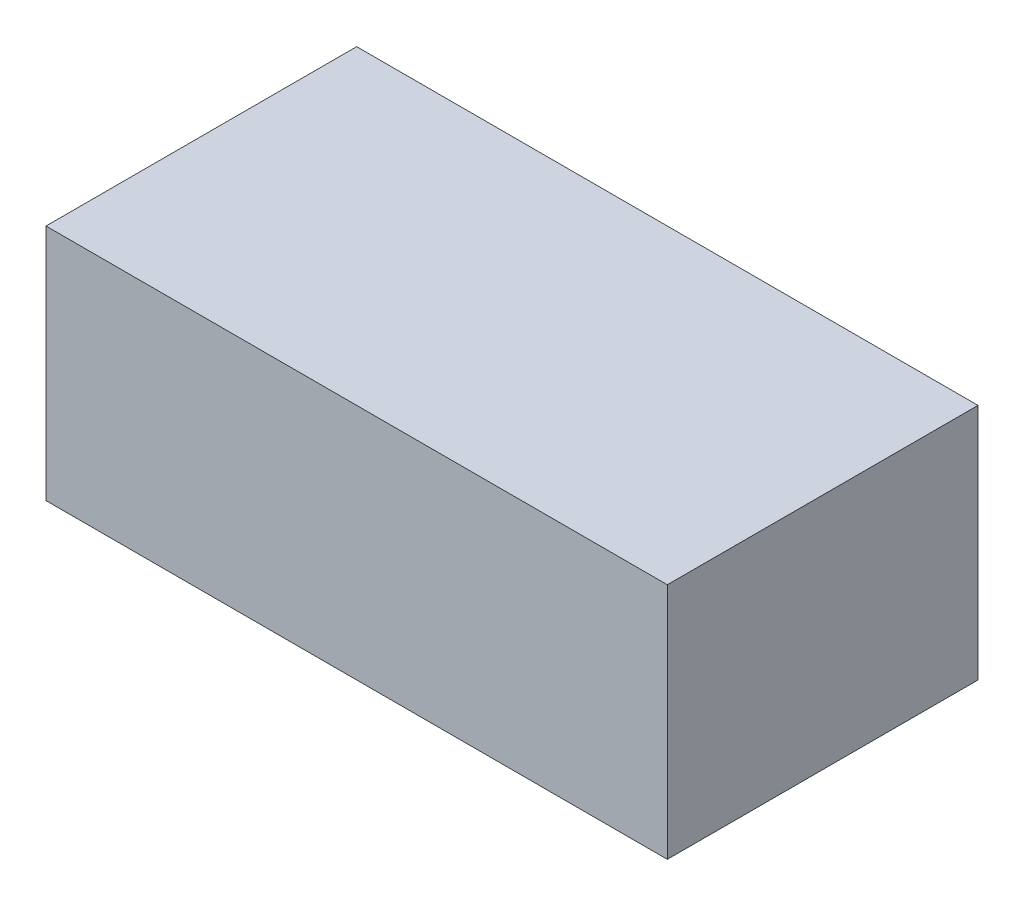
ISO-10303-21;
HEADER;
FILE_DESCRIPTION(('STEP AP214'),'2;1');
FILE_NAME('part.step','',(''),(''),'','','');
FILE_SCHEMA(('AUTOMOTIVE_DESIGN { 1 0 10303 214 1 1 1 1 }'));
ENDSEC;
DATA;
#1=APPLICATION_CONTEXT('core data for automotive mechanical design processes');
#2=APPLICATION_PROTOCOL_DEFINITION('international standard','automotive_design',2000,#1);
#3=PRODUCT_CONTEXT('',#1,'mechanical');
#4=PRODUCT('Part','Part','',(#3));
#5=PRODUCT_RELATED_PRODUCT_CATEGORY('part','',(#4));
#6=PRODUCT_DEFINITION_FORMATION('','',#4);
#7=PRODUCT_DEFINITION_CONTEXT('part definition',#1,'design');
#8=PRODUCT_DEFINITION('design','',#6,#7);
#9=PRODUCT_DEFINITION_SHAPE('','',#8);
#10=(LENGTH_UNIT() NAMED_UNIT(*) SI_UNIT(.MILLI.,.METRE.));
#11=(NAMED_UNIT(*) PLANE_ANGLE_UNIT() SI_UNIT($,.RADIAN.));
#12=(NAMED_UNIT(*) SI_UNIT($,.STERADIAN.) SOLID_ANGLE_UNIT());
#13=UNCERTAINTY_MEASURE_WITH_UNIT(LENGTH_MEASURE(1.E-05),#10,'distance_accuracy_value','');
#14=(GEOMETRIC_REPRESENTATION_CONTEXT(3) GLOBAL_UNCERTAINTY_ASSIGNED_CONTEXT((#13)) GLOBAL_UNIT_ASSIGNED_CONTEXT((#10,
#11,#12)) REPRESENTATION_CONTEXT('',''));
#15=CARTESIAN_POINT('',(0.,0.,0.));
#16=DIRECTION('',(0.,0.,1.));
#17=DIRECTION('',(1.,0.,0.));
#18=AXIS2_PLACEMENT_3D('',#15,#16,#17);
#19=CARTESIAN_POINT('',(0.,0.,0.));
#20=DIRECTION('',(0.,1.,0.));
#21=DIRECTION('',(0.,0.,1.));
#22=AXIS2_PLACEMENT_3D('',#19,#20,#21);
#23=PLANE('',#22);
#24=DIRECTION('',(0.,0.,-1.));
#25=VECTOR('',#24,1.);
#26=CARTESIAN_POINT('',(145.,0.,-72.5));
#27=LINE('',#26,#25);
#28=CARTESIAN_POINT('',(145.,0.,72.5));
#29=VERTEX_POINT('',#28);
#30=CARTESIAN_POINT('',(145.,0.,-72.5));
#31=VERTEX_POINT('',#30);
#32=EDGE_CURVE('E137',#29,#31,#27,.T.);
#33=ORIENTED_EDGE('',*,*,#32,.F.);
#34=DIRECTION('',(1.,0.,0.));
#35=VECTOR('',#34,1.);
#36=CARTESIAN_POINT('',(-145.,0.,72.5));
#37=LINE('',#36,#35);
#38=CARTESIAN_POINT('',(-145.,0.,72.5));
#39=VERTEX_POINT('',#38);
#40=EDGE_CURVE('E88',#39,#29,#37,.T.);
#41=ORIENTED_EDGE('',*,*,#40,.F.);
#42=DIRECTION('',(0.,0.,1.));
#43=VECTOR('',#42,1.);
#44=CARTESIAN_POINT('',(-145.,0.,-72.5));
#45=LINE('',#44,#43);
#46=CARTESIAN_POINT('',(-145.,0.,-72.5));
#47=VERTEX_POINT('',#46);
#48=EDGE_CURVE('E155',#47,#39,#45,.T.);
#49=ORIENTED_EDGE('',*,*,#48,.F.);
#50=DIRECTION('',(-1.,0.,0.));
#51=VECTOR('',#50,1.);
#52=CARTESIAN_POINT('',(-145.,0.,-72.5));
#53=LINE('',#52,#51);
#54=EDGE_CURVE('E141',#31,#47,#53,.T.);
#55=ORIENTED_EDGE('',*,*,#54,.F.);
#56=EDGE_LOOP('',(#33,#41,#49,#55));
#57=FACE_BOUND('',#56,.T.);
#58=DIRECTION('',(0.,0.,1.));
#59=VECTOR('',#58,1.);
#60=CARTESIAN_POINT('',(-143.,0.,-70.5));
#61=LINE('',#60,#59);
#62=CARTESIAN_POINT('',(-143.,0.,-70.5));
#63=VERTEX_POINT('',#62);
#64=CARTESIAN_POINT('',(-143.,0.,70.5));
#65=VERTEX_POINT('',#64);
#66=EDGE_CURVE('E58',#63,#65,#61,.T.);
#67=ORIENTED_EDGE('',*,*,#66,.T.);
#68=DIRECTION('',(1.,0.,0.));
#69=VECTOR('',#68,1.);
#70=CARTESIAN_POINT('',(-143.,0.,70.5));
#71=LINE('',#70,#69);
#72=CARTESIAN_POINT('',(143.,0.,70.5));
#73=VERTEX_POINT('',#72);
#74=EDGE_CURVE('E136',#65,#73,#71,.T.);
#75=ORIENTED_EDGE('',*,*,#74,.T.);
#76=DIRECTION('',(0.,0.,-1.));
#77=VECTOR('',#76,1.);
#78=CARTESIAN_POINT('',(143.,0.,-70.5));
#79=LINE('',#78,#77);
#80=CARTESIAN_POINT('',(143.,0.,-70.5));
#81=VERTEX_POINT('',#80);
#82=EDGE_CURVE('E269',#73,#81,#79,.T.);
#83=ORIENTED_EDGE('',*,*,#82,.T.);
#84=DIRECTION('',(-1.,0.,0.));
#85=VECTOR('',#84,1.);
#86=CARTESIAN_POINT('',(-143.,0.,-70.5));
#87=LINE('',#86,#85);
#88=EDGE_CURVE('E132',#81,#63,#87,.T.);
#89=ORIENTED_EDGE('',*,*,#88,.T.);
#90=EDGE_LOOP('',(#67,#75,#83,#89));
#91=FACE_BOUND('',#90,.T.);
#92=ADVANCED_FACE('F43',(#57,#91),#23,.F.);
#93=CARTESIAN_POINT('',(145.,111.,-72.5));
#94=DIRECTION('',(-1.,0.,0.));
#95=DIRECTION('',(0.,0.,1.));
#96=AXIS2_PLACEMENT_3D('',#93,#94,#95);
#97=PLANE('',#96);
#98=ORIENTED_EDGE('',*,*,#32,.T.);
#99=DIRECTION('',(0.,-1.,0.));
#100=VECTOR('',#99,1.);
#101=CARTESIAN_POINT('',(145.,111.,-72.5));
#102=LINE('',#101,#100);
#103=CARTESIAN_POINT('',(145.,111.,-72.5));
#104=VERTEX_POINT('',#103);
#105=EDGE_CURVE('E11',#104,#31,#102,.T.);
#106=ORIENTED_EDGE('',*,*,#105,.F.);
#107=DIRECTION('',(0.,0.,-1.));
#108=VECTOR('',#107,1.);
#109=CARTESIAN_POINT('',(145.,111.,-72.5));
#110=LINE('',#109,#108);
#111=CARTESIAN_POINT('',(145.,111.,72.5));
#112=VERTEX_POINT('',#111);
#113=EDGE_CURVE('E147',#112,#104,#110,.T.);
#114=ORIENTED_EDGE('',*,*,#113,.F.);
#115=DIRECTION('',(0.,-1.,0.));
#116=VECTOR('',#115,1.);
#117=CARTESIAN_POINT('',(145.,111.,72.5));
#118=LINE('',#117,#116);
#119=EDGE_CURVE('E152',#112,#29,#118,.T.);
#120=ORIENTED_EDGE('',*,*,#119,.T.);
#121=EDGE_LOOP('',(#98,#106,#114,#120));
#122=FACE_BOUND('',#121,.T.);
#123=ADVANCED_FACE('F45',(#122),#97,.F.);
#124=CARTESIAN_POINT('',(-145.,111.,-72.5));
#125=DIRECTION('',(0.,0.,1.));
#126=DIRECTION('',(1.,0.,0.));
#127=AXIS2_PLACEMENT_3D('',#124,#125,#126);
#128=PLANE('',#127);
#129=ORIENTED_EDGE('',*,*,#54,.T.);
#130=DIRECTION('',(0.,-1.,0.));
#131=VECTOR('',#130,1.);
#132=CARTESIAN_POINT('',(-145.,111.,-72.5));
#133=LINE('',#132,#131);
#134=CARTESIAN_POINT('',(-145.,111.,-72.5));
#135=VERTEX_POINT('',#134);
#136=EDGE_CURVE('E51',#135,#47,#133,.T.);
#137=ORIENTED_EDGE('',*,*,#136,.F.);
#138=DIRECTION('',(-1.,0.,0.));
#139=VECTOR('',#138,1.);
#140=CARTESIAN_POINT('',(-145.,111.,-72.5));
#141=LINE('',#140,#139);
#142=EDGE_CURVE('E95',#104,#135,#141,.T.);
#143=ORIENTED_EDGE('',*,*,#142,.F.);
#144=ORIENTED_EDGE('',*,*,#105,.T.);
#145=EDGE_LOOP('',(#129,#137,#143,#144));
#146=FACE_BOUND('',#145,.T.);
#147=ADVANCED_FACE('F181',(#146),#128,.F.);
#148=CARTESIAN_POINT('',(-145.,111.,-72.5));
#149=DIRECTION('',(1.,0.,0.));
#150=DIRECTION('',(0.,0.,-1.));
#151=AXIS2_PLACEMENT_3D('',#148,#149,#150);
#152=PLANE('',#151);
#153=ORIENTED_EDGE('',*,*,#48,.T.);
#154=DIRECTION('',(0.,-1.,0.));
#155=VECTOR('',#154,1.);
#156=CARTESIAN_POINT('',(-145.,111.,72.5));
#157=LINE('',#156,#155);
#158=CARTESIAN_POINT('',(-145.,111.,72.5));
#159=VERTEX_POINT('',#158);
#160=EDGE_CURVE('E159',#159,#39,#157,.T.);
#161=ORIENTED_EDGE('',*,*,#160,.F.);
#162=DIRECTION('',(0.,0.,1.));
#163=VECTOR('',#162,1.);
#164=CARTESIAN_POINT('',(-145.,111.,-72.5));
#165=LINE('',#164,#163);
#166=EDGE_CURVE('E150',#135,#159,#165,.T.);
#167=ORIENTED_EDGE('',*,*,#166,.F.);
#168=ORIENTED_EDGE('',*,*,#136,.T.);
#169=EDGE_LOOP('',(#153,#161,#167,#168));
#170=FACE_BOUND('',#169,.T.);
#171=ADVANCED_FACE('F164',(#170),#152,.F.);
#172=CARTESIAN_POINT('',(-145.,111.,72.5));
#173=DIRECTION('',(0.,0.,-1.));
#174=DIRECTION('',(-1.,0.,0.));
#175=AXIS2_PLACEMENT_3D('',#172,#173,#174);
#176=PLANE('',#175);
#177=ORIENTED_EDGE('',*,*,#40,.T.);
#178=ORIENTED_EDGE('',*,*,#119,.F.);
#179=DIRECTION('',(1.,0.,0.));
#180=VECTOR('',#179,1.);
#181=CARTESIAN_POINT('',(-145.,111.,72.5));
#182=LINE('',#181,#180);
#183=EDGE_CURVE('E67',#159,#112,#182,.T.);
#184=ORIENTED_EDGE('',*,*,#183,.F.);
#185=ORIENTED_EDGE('',*,*,#160,.T.);
#186=EDGE_LOOP('',(#177,#178,#184,#185));
#187=FACE_BOUND('',#186,.T.);
#188=ADVANCED_FACE('F172',(#187),#176,.F.);
#189=CARTESIAN_POINT('',(0.,111.,0.));
#190=DIRECTION('',(0.,1.,0.));
#191=DIRECTION('',(0.,0.,1.));
#192=AXIS2_PLACEMENT_3D('',#189,#190,#191);
#193=PLANE('',#192);
#194=ORIENTED_EDGE('',*,*,#113,.T.);
#195=ORIENTED_EDGE('',*,*,#142,.T.);
#196=ORIENTED_EDGE('',*,*,#166,.T.);
#197=ORIENTED_EDGE('',*,*,#183,.T.);
#198=EDGE_LOOP('',(#194,#195,#196,#197));
#199=FACE_BOUND('',#198,.T.);
#200=ADVANCED_FACE('F174',(#199),#193,.T.);
#201=CARTESIAN_POINT('',(-143.,110.8,-70.5));
#202=DIRECTION('',(1.,0.,0.));
#203=DIRECTION('',(0.,0.,-1.));
#204=AXIS2_PLACEMENT_3D('',#201,#202,#203);
#205=PLANE('',#204);
#206=ORIENTED_EDGE('',*,*,#66,.F.);
#207=DIRECTION('',(0.,-1.,0.));
#208=VECTOR('',#207,1.);
#209=CARTESIAN_POINT('',(-143.,110.8,-70.5));
#210=LINE('',#209,#208);
#211=CARTESIAN_POINT('',(-143.,110.8,-70.5));
#212=VERTEX_POINT('',#211);
#213=EDGE_CURVE('E131',#212,#63,#210,.T.);
#214=ORIENTED_EDGE('',*,*,#213,.F.);
#215=DIRECTION('',(0.,0.,1.));
#216=VECTOR('',#215,1.);
#217=CARTESIAN_POINT('',(-143.,110.8,-70.5));
#218=LINE('',#217,#216);
#219=CARTESIAN_POINT('',(-143.,110.8,70.5));
#220=VERTEX_POINT('',#219);
#221=EDGE_CURVE('E123',#212,#220,#218,.T.);
#222=ORIENTED_EDGE('',*,*,#221,.T.);
#223=DIRECTION('',(0.,-1.,0.));
#224=VECTOR('',#223,1.);
#225=CARTESIAN_POINT('',(-143.,110.8,70.5));
#226=LINE('',#225,#224);
#227=EDGE_CURVE('E130',#220,#65,#226,.T.);
#228=ORIENTED_EDGE('',*,*,#227,.T.);
#229=EDGE_LOOP('',(#206,#214,#222,#228));
#230=FACE_BOUND('',#229,.T.);
#231=ADVANCED_FACE('F129',(#230),#205,.T.);
#232=CARTESIAN_POINT('',(-143.,110.8,70.5));
#233=DIRECTION('',(0.,0.,-1.));
#234=DIRECTION('',(-1.,0.,0.));
#235=AXIS2_PLACEMENT_3D('',#232,#233,#234);
#236=PLANE('',#235);
#237=ORIENTED_EDGE('',*,*,#74,.F.);
#238=ORIENTED_EDGE('',*,*,#227,.F.);
#239=DIRECTION('',(1.,0.,0.));
#240=VECTOR('',#239,1.);
#241=CARTESIAN_POINT('',(-143.,110.8,70.5));
#242=LINE('',#241,#240);
#243=CARTESIAN_POINT('',(143.,110.8,70.5));
#244=VERTEX_POINT('',#243);
#245=EDGE_CURVE('E119',#220,#244,#242,.T.);
#246=ORIENTED_EDGE('',*,*,#245,.T.);
#247=DIRECTION('',(0.,-1.,0.));
#248=VECTOR('',#247,1.);
#249=CARTESIAN_POINT('',(143.,110.8,70.5));
#250=LINE('',#249,#248);
#251=EDGE_CURVE('E138',#244,#73,#250,.T.);
#252=ORIENTED_EDGE('',*,*,#251,.T.);
#253=EDGE_LOOP('',(#237,#238,#246,#252));
#254=FACE_BOUND('',#253,.T.);
#255=ADVANCED_FACE('F134',(#254),#236,.T.);
#256=CARTESIAN_POINT('',(143.,110.8,-70.5));
#257=DIRECTION('',(-1.,0.,0.));
#258=DIRECTION('',(0.,0.,1.));
#259=AXIS2_PLACEMENT_3D('',#256,#257,#258);
#260=PLANE('',#259);
#261=ORIENTED_EDGE('',*,*,#82,.F.);
#262=ORIENTED_EDGE('',*,*,#251,.F.);
#263=DIRECTION('',(0.,0.,-1.));
#264=VECTOR('',#263,1.);
#265=CARTESIAN_POINT('',(143.,110.8,-70.5));
#266=LINE('',#265,#264);
#267=CARTESIAN_POINT('',(143.,110.8,-70.5));
#268=VERTEX_POINT('',#267);
#269=EDGE_CURVE('E124',#244,#268,#266,.T.);
#270=ORIENTED_EDGE('',*,*,#269,.T.);
#271=DIRECTION('',(0.,-1.,0.));
#272=VECTOR('',#271,1.);
#273=CARTESIAN_POINT('',(143.,110.8,-70.5));
#274=LINE('',#273,#272);
#275=EDGE_CURVE('E143',#268,#81,#274,.T.);
#276=ORIENTED_EDGE('',*,*,#275,.T.);
#277=EDGE_LOOP('',(#261,#262,#270,#276));
#278=FACE_BOUND('',#277,.T.);
#279=ADVANCED_FACE('F193',(#278),#260,.T.);
#280=CARTESIAN_POINT('',(-143.,110.8,-70.5));
#281=DIRECTION('',(0.,0.,1.));
#282=DIRECTION('',(1.,0.,0.));
#283=AXIS2_PLACEMENT_3D('',#280,#281,#282);
#284=PLANE('',#283);
#285=ORIENTED_EDGE('',*,*,#88,.F.);
#286=ORIENTED_EDGE('',*,*,#275,.F.);
#287=DIRECTION('',(-1.,0.,0.));
#288=VECTOR('',#287,1.);
#289=CARTESIAN_POINT('',(-143.,110.8,-70.5));
#290=LINE('',#289,#288);
#291=EDGE_CURVE('E276',#268,#212,#290,.T.);
#292=ORIENTED_EDGE('',*,*,#291,.T.);
#293=ORIENTED_EDGE('',*,*,#213,.T.);
#294=EDGE_LOOP('',(#285,#286,#292,#293));
#295=FACE_BOUND('',#294,.T.);
#296=ADVANCED_FACE('F196',(#295),#284,.T.);
#297=CARTESIAN_POINT('',(0.,110.8,0.));
#298=DIRECTION('',(0.,1.,0.));
#299=DIRECTION('',(0.,0.,1.));
#300=AXIS2_PLACEMENT_3D('',#297,#298,#299);
#301=PLANE('',#300);
#302=ORIENTED_EDGE('',*,*,#221,.F.);
#303=ORIENTED_EDGE('',*,*,#291,.F.);
#304=ORIENTED_EDGE('',*,*,#269,.F.);
#305=ORIENTED_EDGE('',*,*,#245,.F.);
#306=EDGE_LOOP('',(#302,#303,#304,#305));
#307=FACE_BOUND('',#306,.T.);
#308=ADVANCED_FACE('F121',(#307),#301,.F.);
#309=CLOSED_SHELL('',(#92,#123,#147,#171,#188,#200,#231,#255,#279,#296,#308));
#310=MANIFOLD_SOLID_BREP('B2',#309);
#311=ADVANCED_BREP_SHAPE_REPRESENTATION('',(#18,#310),#14);
#312=SHAPE_DEFINITION_REPRESENTATION(#9,#311);
ENDSEC;
END-ISO-10303-21;
